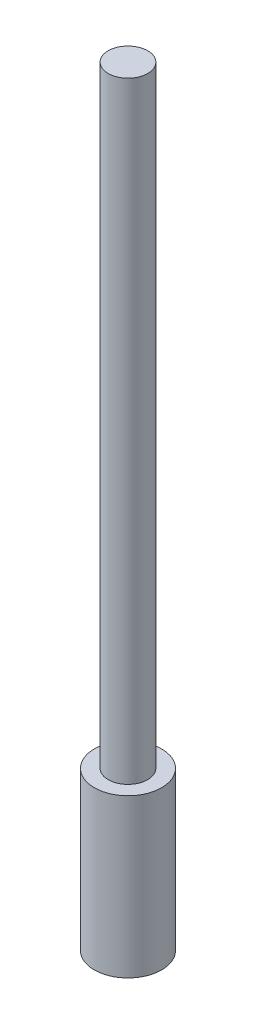
ISO-10303-21;
HEADER;
FILE_DESCRIPTION(('STEP AP214'),'2;1');
FILE_NAME('part.step','',(''),(''),'','','');
FILE_SCHEMA(('AUTOMOTIVE_DESIGN { 1 0 10303 214 1 1 1 1 }'));
ENDSEC;
DATA;
#1=APPLICATION_CONTEXT('core data for automotive mechanical design processes');
#2=APPLICATION_PROTOCOL_DEFINITION('international standard','automotive_design',2000,#1);
#3=PRODUCT_CONTEXT('',#1,'mechanical');
#4=PRODUCT('Part','Part','',(#3));
#5=PRODUCT_RELATED_PRODUCT_CATEGORY('part','',(#4));
#6=PRODUCT_DEFINITION_FORMATION('','',#4);
#7=PRODUCT_DEFINITION_CONTEXT('part definition',#1,'design');
#8=PRODUCT_DEFINITION('design','',#6,#7);
#9=PRODUCT_DEFINITION_SHAPE('','',#8);
#10=(LENGTH_UNIT() NAMED_UNIT(*) SI_UNIT(.MILLI.,.METRE.));
#11=(NAMED_UNIT(*) PLANE_ANGLE_UNIT() SI_UNIT($,.RADIAN.));
#12=(NAMED_UNIT(*) SI_UNIT($,.STERADIAN.) SOLID_ANGLE_UNIT());
#13=UNCERTAINTY_MEASURE_WITH_UNIT(LENGTH_MEASURE(1.E-05),#10,'distance_accuracy_value','');
#14=(GEOMETRIC_REPRESENTATION_CONTEXT(3) GLOBAL_UNCERTAINTY_ASSIGNED_CONTEXT((#13)) GLOBAL_UNIT_ASSIGNED_CONTEXT((#10,
#11,#12)) REPRESENTATION_CONTEXT('',''));
#15=CARTESIAN_POINT('',(0.,0.,0.));
#16=DIRECTION('',(0.,0.,1.));
#17=DIRECTION('',(1.,0.,0.));
#18=AXIS2_PLACEMENT_3D('',#15,#16,#17);
#19=CARTESIAN_POINT('',(0.,40.,0.));
#20=DIRECTION('',(0.,1.,0.));
#21=DIRECTION('',(0.,0.,1.));
#22=AXIS2_PLACEMENT_3D('',#19,#20,#21);
#23=PLANE('',#22);
#24=CARTESIAN_POINT('',(0.,40.,0.));
#25=DIRECTION('',(0.,1.,0.));
#26=DIRECTION('',(0.,0.,1.));
#27=AXIS2_PLACEMENT_3D('',#24,#25,#26);
#28=CIRCLE('',#27,8.525);
#29=CARTESIAN_POINT('',(0.,40.,8.525));
#30=VERTEX_POINT('',#29);
#31=EDGE_CURVE('E10',#30,#30,#28,.T.);
#32=ORIENTED_EDGE('',*,*,#31,.T.);
#33=EDGE_LOOP('',(#32));
#34=FACE_BOUND('',#33,.T.);
#35=CARTESIAN_POINT('',(0.,40.,0.));
#36=DIRECTION('',(0.,1.,0.));
#37=DIRECTION('',(0.,0.,1.));
#38=AXIS2_PLACEMENT_3D('',#35,#36,#37);
#39=CIRCLE('',#38,5.);
#40=CARTESIAN_POINT('',(0.,40.,5.));
#41=VERTEX_POINT('',#40);
#42=EDGE_CURVE('E44',#41,#41,#39,.T.);
#43=ORIENTED_EDGE('',*,*,#42,.F.);
#44=EDGE_LOOP('',(#43));
#45=FACE_BOUND('',#44,.T.);
#46=ADVANCED_FACE('F31',(#34,#45),#23,.T.);
#47=CARTESIAN_POINT('',(0.,40.,0.));
#48=DIRECTION('',(0.,-1.,0.));
#49=DIRECTION('',(0.,0.,-1.));
#50=AXIS2_PLACEMENT_3D('',#47,#48,#49);
#51=CYLINDRICAL_SURFACE('',#50,8.525);
#52=ORIENTED_EDGE('',*,*,#31,.F.);
#53=EDGE_LOOP('',(#52));
#54=FACE_BOUND('',#53,.T.);
#55=CARTESIAN_POINT('',(0.,0.,0.));
#56=DIRECTION('',(0.,1.,0.));
#57=DIRECTION('',(0.,0.,1.));
#58=AXIS2_PLACEMENT_3D('',#55,#56,#57);
#59=CIRCLE('',#58,8.525);
#60=CARTESIAN_POINT('',(0.,0.,8.525));
#61=VERTEX_POINT('',#60);
#62=EDGE_CURVE('E35',#61,#61,#59,.T.);
#63=ORIENTED_EDGE('',*,*,#62,.T.);
#64=EDGE_LOOP('',(#63));
#65=FACE_BOUND('',#64,.T.);
#66=ADVANCED_FACE('F33',(#54,#65),#51,.T.);
#67=CARTESIAN_POINT('',(0.,0.,0.));
#68=DIRECTION('',(0.,1.,0.));
#69=DIRECTION('',(0.,0.,1.));
#70=AXIS2_PLACEMENT_3D('',#67,#68,#69);
#71=PLANE('',#70);
#72=ORIENTED_EDGE('',*,*,#62,.F.);
#73=EDGE_LOOP('',(#72));
#74=FACE_BOUND('',#73,.T.);
#75=ADVANCED_FACE('F55',(#74),#71,.F.);
#76=CARTESIAN_POINT('',(0.,195.,0.));
#77=DIRECTION('',(0.,-1.,0.));
#78=DIRECTION('',(0.,0.,-1.));
#79=AXIS2_PLACEMENT_3D('',#76,#77,#78);
#80=CYLINDRICAL_SURFACE('',#79,5.);
#81=CARTESIAN_POINT('',(0.,195.,0.));
#82=DIRECTION('',(0.,1.,0.));
#83=DIRECTION('',(0.,0.,1.));
#84=AXIS2_PLACEMENT_3D('',#81,#82,#83);
#85=CIRCLE('',#84,5.);
#86=CARTESIAN_POINT('',(0.,195.,5.));
#87=VERTEX_POINT('',#86);
#88=EDGE_CURVE('E42',#87,#87,#85,.T.);
#89=ORIENTED_EDGE('',*,*,#88,.F.);
#90=EDGE_LOOP('',(#89));
#91=FACE_BOUND('',#90,.T.);
#92=ORIENTED_EDGE('',*,*,#42,.T.);
#93=EDGE_LOOP('',(#92));
#94=FACE_BOUND('',#93,.T.);
#95=ADVANCED_FACE('F52',(#91,#94),#80,.T.);
#96=CARTESIAN_POINT('',(0.,195.,0.));
#97=DIRECTION('',(0.,1.,0.));
#98=DIRECTION('',(0.,0.,1.));
#99=AXIS2_PLACEMENT_3D('',#96,#97,#98);
#100=PLANE('',#99);
#101=ORIENTED_EDGE('',*,*,#88,.T.);
#102=EDGE_LOOP('',(#101));
#103=FACE_BOUND('',#102,.T.);
#104=ADVANCED_FACE('F50',(#103),#100,.T.);
#105=CLOSED_SHELL('',(#46,#66,#75,#95,#104));
#106=MANIFOLD_SOLID_BREP('B2',#105);
#107=ADVANCED_BREP_SHAPE_REPRESENTATION('',(#18,#106),#14);
#108=SHAPE_DEFINITION_REPRESENTATION(#9,#107);
ENDSEC;
END-ISO-10303-21;
